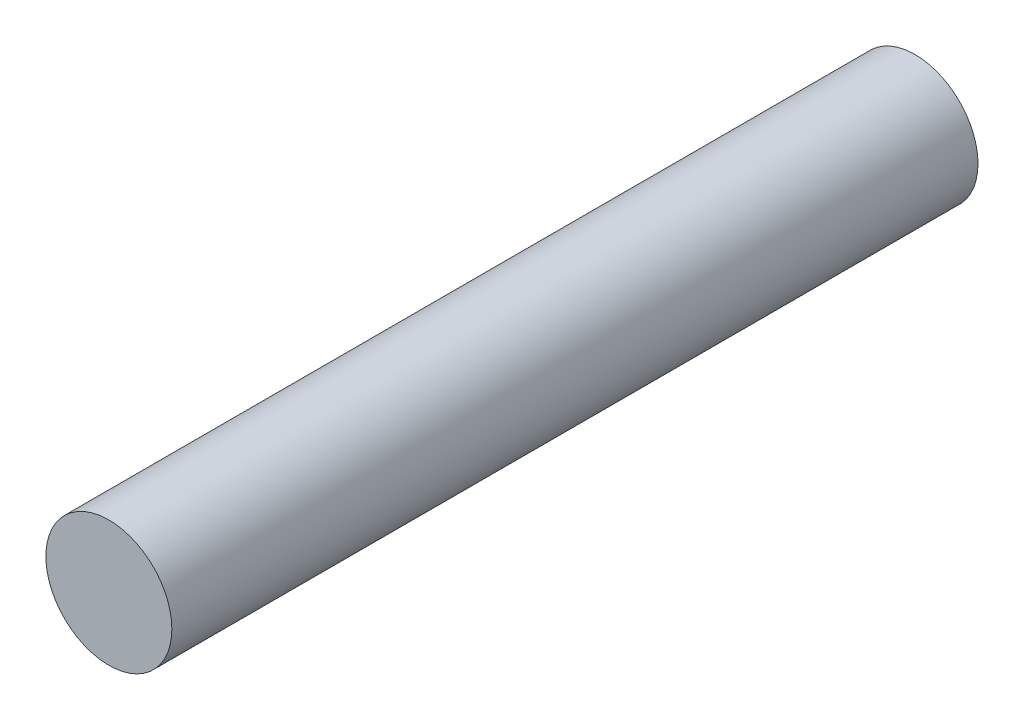
ISO-10303-21;
HEADER;
FILE_DESCRIPTION(('STEP AP214'),'2;1');
FILE_NAME('part.step','',(''),(''),'','','');
FILE_SCHEMA(('AUTOMOTIVE_DESIGN { 1 0 10303 214 1 1 1 1 }'));
ENDSEC;
DATA;
#1=APPLICATION_CONTEXT('core data for automotive mechanical design processes');
#2=APPLICATION_PROTOCOL_DEFINITION('international standard','automotive_design',2000,#1);
#3=PRODUCT_CONTEXT('',#1,'mechanical');
#4=PRODUCT('Part','Part','',(#3));
#5=PRODUCT_RELATED_PRODUCT_CATEGORY('part','',(#4));
#6=PRODUCT_DEFINITION_FORMATION('','',#4);
#7=PRODUCT_DEFINITION_CONTEXT('part definition',#1,'design');
#8=PRODUCT_DEFINITION('design','',#6,#7);
#9=PRODUCT_DEFINITION_SHAPE('','',#8);
#10=(LENGTH_UNIT() NAMED_UNIT(*) SI_UNIT(.MILLI.,.METRE.));
#11=(NAMED_UNIT(*) PLANE_ANGLE_UNIT() SI_UNIT($,.RADIAN.));
#12=(NAMED_UNIT(*) SI_UNIT($,.STERADIAN.) SOLID_ANGLE_UNIT());
#13=UNCERTAINTY_MEASURE_WITH_UNIT(LENGTH_MEASURE(1.E-05),#10,'distance_accuracy_value','');
#14=(GEOMETRIC_REPRESENTATION_CONTEXT(3) GLOBAL_UNCERTAINTY_ASSIGNED_CONTEXT((#13)) GLOBAL_UNIT_ASSIGNED_CONTEXT((#10,
#11,#12)) REPRESENTATION_CONTEXT('',''));
#15=CARTESIAN_POINT('',(0.,0.,0.));
#16=DIRECTION('',(0.,0.,1.));
#17=DIRECTION('',(1.,0.,0.));
#18=AXIS2_PLACEMENT_3D('',#15,#16,#17);
#19=CARTESIAN_POINT('',(0.,0.,25.4));
#20=DIRECTION('',(0.,0.,-1.));
#21=DIRECTION('',(-1.,0.,0.));
#22=AXIS2_PLACEMENT_3D('',#19,#20,#21);
#23=CYLINDRICAL_SURFACE('',#22,1.984375);
#24=CARTESIAN_POINT('',(0.,0.,25.4));
#25=DIRECTION('',(0.,0.,1.));
#26=DIRECTION('',(1.,0.,0.));
#27=AXIS2_PLACEMENT_3D('',#24,#25,#26);
#28=CIRCLE('',#27,1.984375);
#29=CARTESIAN_POINT('',(1.984375,0.,25.4));
#30=VERTEX_POINT('',#29);
#31=EDGE_CURVE('E10',#30,#30,#28,.T.);
#32=ORIENTED_EDGE('',*,*,#31,.F.);
#33=EDGE_LOOP('',(#32));
#34=FACE_BOUND('',#33,.T.);
#35=CARTESIAN_POINT('',(0.,0.,0.));
#36=DIRECTION('',(0.,0.,1.));
#37=DIRECTION('',(1.,0.,0.));
#38=AXIS2_PLACEMENT_3D('',#35,#36,#37);
#39=CIRCLE('',#38,1.984375);
#40=CARTESIAN_POINT('',(1.984375,0.,0.));
#41=VERTEX_POINT('',#40);
#42=EDGE_CURVE('E35',#41,#41,#39,.T.);
#43=ORIENTED_EDGE('',*,*,#42,.T.);
#44=EDGE_LOOP('',(#43));
#45=FACE_BOUND('',#44,.T.);
#46=ADVANCED_FACE('F32',(#34,#45),#23,.T.);
#47=CARTESIAN_POINT('',(0.,0.,25.4));
#48=DIRECTION('',(0.,0.,1.));
#49=DIRECTION('',(1.,0.,0.));
#50=AXIS2_PLACEMENT_3D('',#47,#48,#49);
#51=PLANE('',#50);
#52=ORIENTED_EDGE('',*,*,#31,.T.);
#53=EDGE_LOOP('',(#52));
#54=FACE_BOUND('',#53,.T.);
#55=ADVANCED_FACE('F47',(#54),#51,.T.);
#56=CARTESIAN_POINT('',(0.,0.,0.));
#57=DIRECTION('',(0.,0.,1.));
#58=DIRECTION('',(1.,0.,0.));
#59=AXIS2_PLACEMENT_3D('',#56,#57,#58);
#60=PLANE('',#59);
#61=ORIENTED_EDGE('',*,*,#42,.F.);
#62=EDGE_LOOP('',(#61));
#63=FACE_BOUND('',#62,.T.);
#64=ADVANCED_FACE('F45',(#63),#60,.F.);
#65=CLOSED_SHELL('',(#46,#55,#64));
#66=MANIFOLD_SOLID_BREP('B2',#65);
#67=ADVANCED_BREP_SHAPE_REPRESENTATION('',(#18,#66),#14);
#68=SHAPE_DEFINITION_REPRESENTATION(#9,#67);
ENDSEC;
END-ISO-10303-21;
